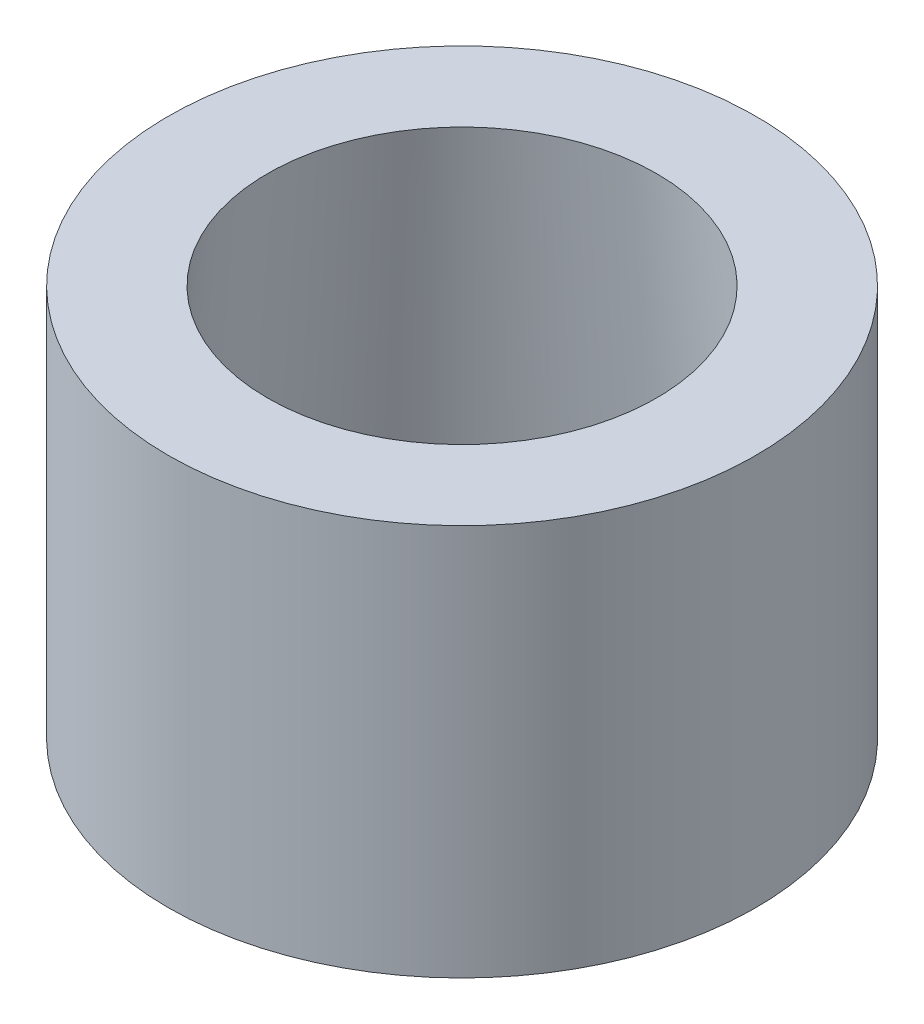
ISO-10303-21;
HEADER;
FILE_DESCRIPTION(('STEP AP214'),'2;1');
FILE_NAME('part.step','',(''),(''),'','','');
FILE_SCHEMA(('AUTOMOTIVE_DESIGN { 1 0 10303 214 1 1 1 1 }'));
ENDSEC;
DATA;
#1=APPLICATION_CONTEXT('core data for automotive mechanical design processes');
#2=APPLICATION_PROTOCOL_DEFINITION('international standard','automotive_design',2000,#1);
#3=PRODUCT_CONTEXT('',#1,'mechanical');
#4=PRODUCT('Part','Part','',(#3));
#5=PRODUCT_RELATED_PRODUCT_CATEGORY('part','',(#4));
#6=PRODUCT_DEFINITION_FORMATION('','',#4);
#7=PRODUCT_DEFINITION_CONTEXT('part definition',#1,'design');
#8=PRODUCT_DEFINITION('design','',#6,#7);
#9=PRODUCT_DEFINITION_SHAPE('','',#8);
#10=(LENGTH_UNIT() NAMED_UNIT(*) SI_UNIT(.MILLI.,.METRE.));
#11=(NAMED_UNIT(*) PLANE_ANGLE_UNIT() SI_UNIT($,.RADIAN.));
#12=(NAMED_UNIT(*) SI_UNIT($,.STERADIAN.) SOLID_ANGLE_UNIT());
#13=UNCERTAINTY_MEASURE_WITH_UNIT(LENGTH_MEASURE(1.E-05),#10,'distance_accuracy_value','');
#14=(GEOMETRIC_REPRESENTATION_CONTEXT(3) GLOBAL_UNCERTAINTY_ASSIGNED_CONTEXT((#13)) GLOBAL_UNIT_ASSIGNED_CONTEXT((#10,
#11,#12)) REPRESENTATION_CONTEXT('',''));
#15=CARTESIAN_POINT('',(0.,0.,0.));
#16=DIRECTION('',(0.,0.,1.));
#17=DIRECTION('',(1.,0.,0.));
#18=AXIS2_PLACEMENT_3D('',#15,#16,#17);
#19=CARTESIAN_POINT('',(0.,25.4,0.));
#20=DIRECTION('',(0.,-1.,0.));
#21=DIRECTION('',(0.,0.,-1.));
#22=AXIS2_PLACEMENT_3D('',#19,#20,#21);
#23=CYLINDRICAL_SURFACE('',#22,19.05);
#24=CARTESIAN_POINT('',(0.,25.4,0.));
#25=DIRECTION('',(0.,1.,0.));
#26=DIRECTION('',(0.,0.,1.));
#27=AXIS2_PLACEMENT_3D('',#24,#25,#26);
#28=CIRCLE('',#27,19.05);
#29=CARTESIAN_POINT('',(0.,25.4,19.05));
#30=VERTEX_POINT('',#29);
#31=EDGE_CURVE('E11',#30,#30,#28,.T.);
#32=ORIENTED_EDGE('',*,*,#31,.F.);
#33=EDGE_LOOP('',(#32));
#34=FACE_BOUND('',#33,.T.);
#35=CARTESIAN_POINT('',(0.,0.,0.));
#36=DIRECTION('',(0.,1.,0.));
#37=DIRECTION('',(0.,0.,1.));
#38=AXIS2_PLACEMENT_3D('',#35,#36,#37);
#39=CIRCLE('',#38,19.05);
#40=CARTESIAN_POINT('',(0.,0.,19.05));
#41=VERTEX_POINT('',#40);
#42=EDGE_CURVE('E44',#41,#41,#39,.T.);
#43=ORIENTED_EDGE('',*,*,#42,.T.);
#44=EDGE_LOOP('',(#43));
#45=FACE_BOUND('',#44,.T.);
#46=ADVANCED_FACE('F41',(#34,#45),#23,.T.);
#47=CARTESIAN_POINT('',(0.,25.4,0.));
#48=DIRECTION('',(0.,1.,0.));
#49=DIRECTION('',(0.,0.,1.));
#50=AXIS2_PLACEMENT_3D('',#47,#48,#49);
#51=PLANE('',#50);
#52=CARTESIAN_POINT('',(0.,25.4,0.));
#53=DIRECTION('',(0.,1.,0.));
#54=DIRECTION('',(0.,0.,1.));
#55=AXIS2_PLACEMENT_3D('',#52,#53,#54);
#56=CIRCLE('',#55,12.6111);
#57=CARTESIAN_POINT('',(0.,25.4,12.6111));
#58=VERTEX_POINT('',#57);
#59=EDGE_CURVE('E55',#58,#58,#56,.T.);
#60=ORIENTED_EDGE('',*,*,#59,.F.);
#61=EDGE_LOOP('',(#60));
#62=FACE_BOUND('',#61,.T.);
#63=ORIENTED_EDGE('',*,*,#31,.T.);
#64=EDGE_LOOP('',(#63));
#65=FACE_BOUND('',#64,.T.);
#66=ADVANCED_FACE('F62',(#62,#65),#51,.T.);
#67=CARTESIAN_POINT('',(0.,0.,0.));
#68=DIRECTION('',(0.,1.,0.));
#69=DIRECTION('',(0.,0.,1.));
#70=AXIS2_PLACEMENT_3D('',#67,#68,#69);
#71=PLANE('',#70);
#72=CARTESIAN_POINT('',(0.,0.,0.));
#73=DIRECTION('',(0.,-1.,0.));
#74=DIRECTION('',(0.,0.,-1.));
#75=AXIS2_PLACEMENT_3D('',#72,#73,#74);
#76=CIRCLE('',#75,14.732);
#77=CARTESIAN_POINT('',(0.,0.,-14.732));
#78=VERTEX_POINT('',#77);
#79=EDGE_CURVE('E51',#78,#78,#76,.T.);
#80=ORIENTED_EDGE('',*,*,#79,.F.);
#81=EDGE_LOOP('',(#80));
#82=FACE_BOUND('',#81,.T.);
#83=ORIENTED_EDGE('',*,*,#42,.F.);
#84=EDGE_LOOP('',(#83));
#85=FACE_BOUND('',#84,.T.);
#86=ADVANCED_FACE('F64',(#82,#85),#71,.F.);
#87=CARTESIAN_POINT('',(0.,25.4,0.));
#88=DIRECTION('',(0.,-1.,0.));
#89=DIRECTION('',(0.,0.,-1.));
#90=AXIS2_PLACEMENT_3D('',#87,#88,#89);
#91=CONICAL_SURFACE('',#90,12.6111,0.0833067468453441);
#92=ORIENTED_EDGE('',*,*,#59,.T.);
#93=EDGE_LOOP('',(#92));
#94=FACE_BOUND('',#93,.T.);
#95=ORIENTED_EDGE('',*,*,#79,.T.);
#96=EDGE_LOOP('',(#95));
#97=FACE_BOUND('',#96,.T.);
#98=ADVANCED_FACE('F59',(#94,#97),#91,.F.);
#99=CLOSED_SHELL('',(#46,#66,#86,#98));
#100=MANIFOLD_SOLID_BREP('B2',#99);
#101=ADVANCED_BREP_SHAPE_REPRESENTATION('',(#18,#100),#14);
#102=SHAPE_DEFINITION_REPRESENTATION(#9,#101);
ENDSEC;
END-ISO-10303-21;
